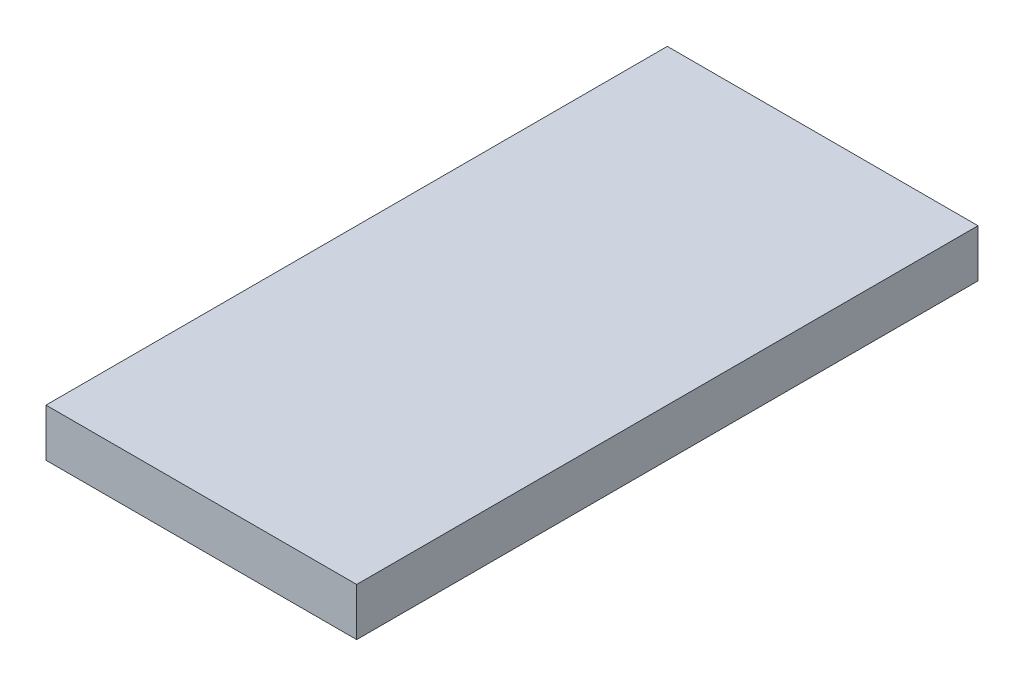
ISO-10303-21;
HEADER;
FILE_DESCRIPTION(('STEP AP214'),'2;1');
FILE_NAME('part.step','',(''),(''),'','','');
FILE_SCHEMA(('AUTOMOTIVE_DESIGN { 1 0 10303 214 1 1 1 1 }'));
ENDSEC;
DATA;
#1=APPLICATION_CONTEXT('core data for automotive mechanical design processes');
#2=APPLICATION_PROTOCOL_DEFINITION('international standard','automotive_design',2000,#1);
#3=PRODUCT_CONTEXT('',#1,'mechanical');
#4=PRODUCT('Part','Part','',(#3));
#5=PRODUCT_RELATED_PRODUCT_CATEGORY('part','',(#4));
#6=PRODUCT_DEFINITION_FORMATION('','',#4);
#7=PRODUCT_DEFINITION_CONTEXT('part definition',#1,'design');
#8=PRODUCT_DEFINITION('design','',#6,#7);
#9=PRODUCT_DEFINITION_SHAPE('','',#8);
#10=(LENGTH_UNIT() NAMED_UNIT(*) SI_UNIT(.MILLI.,.METRE.));
#11=(NAMED_UNIT(*) PLANE_ANGLE_UNIT() SI_UNIT($,.RADIAN.));
#12=(NAMED_UNIT(*) SI_UNIT($,.STERADIAN.) SOLID_ANGLE_UNIT());
#13=UNCERTAINTY_MEASURE_WITH_UNIT(LENGTH_MEASURE(1.E-05),#10,'distance_accuracy_value','');
#14=(GEOMETRIC_REPRESENTATION_CONTEXT(3) GLOBAL_UNCERTAINTY_ASSIGNED_CONTEXT((#13)) GLOBAL_UNIT_ASSIGNED_CONTEXT((#10,
#11,#12)) REPRESENTATION_CONTEXT('',''));
#15=CARTESIAN_POINT('',(0.,0.,0.));
#16=DIRECTION('',(0.,0.,1.));
#17=DIRECTION('',(1.,0.,0.));
#18=AXIS2_PLACEMENT_3D('',#15,#16,#17);
#19=CARTESIAN_POINT('',(32.5,10.,65.));
#20=DIRECTION('',(-1.,0.,0.));
#21=DIRECTION('',(0.,0.,1.));
#22=AXIS2_PLACEMENT_3D('',#19,#20,#21);
#23=PLANE('',#22);
#24=DIRECTION('',(0.,0.,-1.));
#25=VECTOR('',#24,1.);
#26=CARTESIAN_POINT('',(32.5,0.,65.));
#27=LINE('',#26,#25);
#28=CARTESIAN_POINT('',(32.5,0.,65.));
#29=VERTEX_POINT('',#28);
#30=CARTESIAN_POINT('',(32.5,0.,-65.));
#31=VERTEX_POINT('',#30);
#32=EDGE_CURVE('E98',#29,#31,#27,.T.);
#33=ORIENTED_EDGE('',*,*,#32,.T.);
#34=DIRECTION('',(0.,-1.,0.));
#35=VECTOR('',#34,1.);
#36=CARTESIAN_POINT('',(32.5,10.,-65.));
#37=LINE('',#36,#35);
#38=CARTESIAN_POINT('',(32.5,10.,-65.));
#39=VERTEX_POINT('',#38);
#40=EDGE_CURVE('E11',#39,#31,#37,.T.);
#41=ORIENTED_EDGE('',*,*,#40,.F.);
#42=DIRECTION('',(0.,0.,-1.));
#43=VECTOR('',#42,1.);
#44=CARTESIAN_POINT('',(32.5,10.,65.));
#45=LINE('',#44,#43);
#46=CARTESIAN_POINT('',(32.5,10.,65.));
#47=VERTEX_POINT('',#46);
#48=EDGE_CURVE('E86',#47,#39,#45,.T.);
#49=ORIENTED_EDGE('',*,*,#48,.F.);
#50=DIRECTION('',(0.,-1.,0.));
#51=VECTOR('',#50,1.);
#52=CARTESIAN_POINT('',(32.5,10.,65.));
#53=LINE('',#52,#51);
#54=EDGE_CURVE('E94',#47,#29,#53,.T.);
#55=ORIENTED_EDGE('',*,*,#54,.T.);
#56=EDGE_LOOP('',(#33,#41,#49,#55));
#57=FACE_BOUND('',#56,.T.);
#58=ADVANCED_FACE('F35',(#57),#23,.F.);
#59=CARTESIAN_POINT('',(-32.5,10.,-65.));
#60=DIRECTION('',(0.,0.,1.));
#61=DIRECTION('',(1.,0.,0.));
#62=AXIS2_PLACEMENT_3D('',#59,#60,#61);
#63=PLANE('',#62);
#64=DIRECTION('',(-1.,0.,0.));
#65=VECTOR('',#64,1.);
#66=CARTESIAN_POINT('',(-32.5,0.,-65.));
#67=LINE('',#66,#65);
#68=CARTESIAN_POINT('',(-32.5,0.,-65.));
#69=VERTEX_POINT('',#68);
#70=EDGE_CURVE('E90',#31,#69,#67,.T.);
#71=ORIENTED_EDGE('',*,*,#70,.T.);
#72=DIRECTION('',(0.,-1.,0.));
#73=VECTOR('',#72,1.);
#74=CARTESIAN_POINT('',(-32.5,10.,-65.));
#75=LINE('',#74,#73);
#76=CARTESIAN_POINT('',(-32.5,10.,-65.));
#77=VERTEX_POINT('',#76);
#78=EDGE_CURVE('E43',#77,#69,#75,.T.);
#79=ORIENTED_EDGE('',*,*,#78,.F.);
#80=DIRECTION('',(-1.,0.,0.));
#81=VECTOR('',#80,1.);
#82=CARTESIAN_POINT('',(-32.5,10.,-65.));
#83=LINE('',#82,#81);
#84=EDGE_CURVE('E81',#39,#77,#83,.T.);
#85=ORIENTED_EDGE('',*,*,#84,.F.);
#86=ORIENTED_EDGE('',*,*,#40,.T.);
#87=EDGE_LOOP('',(#71,#79,#85,#86));
#88=FACE_BOUND('',#87,.T.);
#89=ADVANCED_FACE('F89',(#88),#63,.F.);
#90=CARTESIAN_POINT('',(-32.5,10.,65.));
#91=DIRECTION('',(1.,0.,0.));
#92=DIRECTION('',(0.,0.,-1.));
#93=AXIS2_PLACEMENT_3D('',#90,#91,#92);
#94=PLANE('',#93);
#95=DIRECTION('',(0.,0.,1.));
#96=VECTOR('',#95,1.);
#97=CARTESIAN_POINT('',(-32.5,0.,65.));
#98=LINE('',#97,#96);
#99=CARTESIAN_POINT('',(-32.5,0.,65.));
#100=VERTEX_POINT('',#99);
#101=EDGE_CURVE('E68',#69,#100,#98,.T.);
#102=ORIENTED_EDGE('',*,*,#101,.T.);
#103=DIRECTION('',(0.,-1.,0.));
#104=VECTOR('',#103,1.);
#105=CARTESIAN_POINT('',(-32.5,10.,65.));
#106=LINE('',#105,#104);
#107=CARTESIAN_POINT('',(-32.5,10.,65.));
#108=VERTEX_POINT('',#107);
#109=EDGE_CURVE('E91',#108,#100,#106,.T.);
#110=ORIENTED_EDGE('',*,*,#109,.F.);
#111=DIRECTION('',(0.,0.,1.));
#112=VECTOR('',#111,1.);
#113=CARTESIAN_POINT('',(-32.5,10.,65.));
#114=LINE('',#113,#112);
#115=EDGE_CURVE('E84',#77,#108,#114,.T.);
#116=ORIENTED_EDGE('',*,*,#115,.F.);
#117=ORIENTED_EDGE('',*,*,#78,.T.);
#118=EDGE_LOOP('',(#102,#110,#116,#117));
#119=FACE_BOUND('',#118,.T.);
#120=ADVANCED_FACE('F92',(#119),#94,.F.);
#121=CARTESIAN_POINT('',(-32.5,10.,65.));
#122=DIRECTION('',(0.,0.,-1.));
#123=DIRECTION('',(-1.,0.,0.));
#124=AXIS2_PLACEMENT_3D('',#121,#122,#123);
#125=PLANE('',#124);
#126=DIRECTION('',(1.,0.,0.));
#127=VECTOR('',#126,1.);
#128=CARTESIAN_POINT('',(-32.5,0.,65.));
#129=LINE('',#128,#127);
#130=EDGE_CURVE('E74',#100,#29,#129,.T.);
#131=ORIENTED_EDGE('',*,*,#130,.T.);
#132=ORIENTED_EDGE('',*,*,#54,.F.);
#133=DIRECTION('',(1.,0.,0.));
#134=VECTOR('',#133,1.);
#135=CARTESIAN_POINT('',(-32.5,10.,65.));
#136=LINE('',#135,#134);
#137=EDGE_CURVE('E51',#108,#47,#136,.T.);
#138=ORIENTED_EDGE('',*,*,#137,.F.);
#139=ORIENTED_EDGE('',*,*,#109,.T.);
#140=EDGE_LOOP('',(#131,#132,#138,#139));
#141=FACE_BOUND('',#140,.T.);
#142=ADVANCED_FACE('F105',(#141),#125,.F.);
#143=CARTESIAN_POINT('',(0.,10.,0.));
#144=DIRECTION('',(0.,-1.,0.));
#145=DIRECTION('',(0.,0.,-1.));
#146=AXIS2_PLACEMENT_3D('',#143,#144,#145);
#147=PLANE('',#146);
#148=ORIENTED_EDGE('',*,*,#48,.T.);
#149=ORIENTED_EDGE('',*,*,#84,.T.);
#150=ORIENTED_EDGE('',*,*,#115,.T.);
#151=ORIENTED_EDGE('',*,*,#137,.T.);
#152=EDGE_LOOP('',(#148,#149,#150,#151));
#153=FACE_BOUND('',#152,.T.);
#154=ADVANCED_FACE('F82',(#153),#147,.F.);
#155=CARTESIAN_POINT('',(0.,0.,0.));
#156=DIRECTION('',(0.,-1.,0.));
#157=DIRECTION('',(0.,0.,-1.));
#158=AXIS2_PLACEMENT_3D('',#155,#156,#157);
#159=PLANE('',#158);
#160=ORIENTED_EDGE('',*,*,#32,.F.);
#161=ORIENTED_EDGE('',*,*,#130,.F.);
#162=ORIENTED_EDGE('',*,*,#101,.F.);
#163=ORIENTED_EDGE('',*,*,#70,.F.);
#164=EDGE_LOOP('',(#160,#161,#162,#163));
#165=FACE_BOUND('',#164,.T.);
#166=ADVANCED_FACE('F108',(#165),#159,.T.);
#167=CLOSED_SHELL('',(#58,#89,#120,#142,#154,#166));
#168=MANIFOLD_SOLID_BREP('B2',#167);
#169=ADVANCED_BREP_SHAPE_REPRESENTATION('',(#18,#168),#14);
#170=SHAPE_DEFINITION_REPRESENTATION(#9,#169);
ENDSEC;
END-ISO-10303-21;
